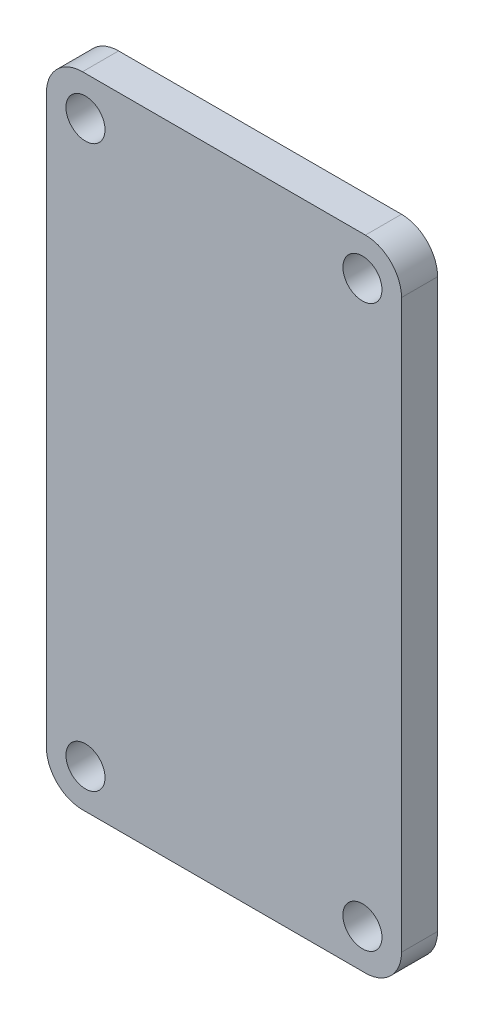
ISO-10303-21;
HEADER;
FILE_DESCRIPTION(('STEP AP214'),'2;1');
FILE_NAME('part.step','',(''),(''),'','','');
FILE_SCHEMA(('AUTOMOTIVE_DESIGN { 1 0 10303 214 1 1 1 1 }'));
ENDSEC;
DATA;
#1=APPLICATION_CONTEXT('core data for automotive mechanical design processes');
#2=APPLICATION_PROTOCOL_DEFINITION('international standard','automotive_design',2000,#1);
#3=PRODUCT_CONTEXT('',#1,'mechanical');
#4=PRODUCT('Part','Part','',(#3));
#5=PRODUCT_RELATED_PRODUCT_CATEGORY('part','',(#4));
#6=PRODUCT_DEFINITION_FORMATION('','',#4);
#7=PRODUCT_DEFINITION_CONTEXT('part definition',#1,'design');
#8=PRODUCT_DEFINITION('design','',#6,#7);
#9=PRODUCT_DEFINITION_SHAPE('','',#8);
#10=(LENGTH_UNIT() NAMED_UNIT(*) SI_UNIT(.MILLI.,.METRE.));
#11=(NAMED_UNIT(*) PLANE_ANGLE_UNIT() SI_UNIT($,.RADIAN.));
#12=(NAMED_UNIT(*) SI_UNIT($,.STERADIAN.) SOLID_ANGLE_UNIT());
#13=UNCERTAINTY_MEASURE_WITH_UNIT(LENGTH_MEASURE(1.E-05),#10,'distance_accuracy_value','');
#14=(GEOMETRIC_REPRESENTATION_CONTEXT(3) GLOBAL_UNCERTAINTY_ASSIGNED_CONTEXT((#13)) GLOBAL_UNIT_ASSIGNED_CONTEXT((#10,
#11,#12)) REPRESENTATION_CONTEXT('',''));
#15=CARTESIAN_POINT('',(0.,0.,0.));
#16=DIRECTION('',(0.,0.,1.));
#17=DIRECTION('',(1.,0.,0.));
#18=AXIS2_PLACEMENT_3D('',#15,#16,#17);
#19=CARTESIAN_POINT('',(0.,0.,2.54));
#20=DIRECTION('',(0.,0.,1.));
#21=DIRECTION('',(1.,0.,0.));
#22=AXIS2_PLACEMENT_3D('',#19,#20,#21);
#23=PLANE('',#22);
#24=CARTESIAN_POINT('',(22.25,-42.25,2.54));
#25=DIRECTION('',(0.,0.,1.));
#26=DIRECTION('',(1.,0.,0.));
#27=AXIS2_PLACEMENT_3D('',#24,#25,#26);
#28=CIRCLE('',#27,1.375);
#29=CARTESIAN_POINT('',(23.625,-42.25,2.54));
#30=VERTEX_POINT('',#29);
#31=EDGE_CURVE('E185',#30,#30,#28,.T.);
#32=ORIENTED_EDGE('',*,*,#31,.F.);
#33=EDGE_LOOP('',(#32));
#34=FACE_BOUND('',#33,.T.);
#35=CARTESIAN_POINT('',(2.75,-2.75,2.54));
#36=DIRECTION('',(0.,0.,1.));
#37=DIRECTION('',(1.,0.,0.));
#38=AXIS2_PLACEMENT_3D('',#35,#36,#37);
#39=CIRCLE('',#38,1.375);
#40=CARTESIAN_POINT('',(4.125,-2.75,2.54));
#41=VERTEX_POINT('',#40);
#42=EDGE_CURVE('E168',#41,#41,#39,.T.);
#43=ORIENTED_EDGE('',*,*,#42,.F.);
#44=EDGE_LOOP('',(#43));
#45=FACE_BOUND('',#44,.T.);
#46=DIRECTION('',(0.,1.,0.));
#47=VECTOR('',#46,1.);
#48=CARTESIAN_POINT('',(25.,0.,2.54));
#49=LINE('',#48,#47);
#50=CARTESIAN_POINT('',(25.,-42.46,2.54));
#51=VERTEX_POINT('',#50);
#52=CARTESIAN_POINT('',(25.,-2.54,2.54));
#53=VERTEX_POINT('',#52);
#54=EDGE_CURVE('E175',#51,#53,#49,.T.);
#55=ORIENTED_EDGE('',*,*,#54,.T.);
#56=CARTESIAN_POINT('',(22.46,-2.54,2.54));
#57=DIRECTION('',(0.,0.,1.));
#58=DIRECTION('',(1.,0.,0.));
#59=AXIS2_PLACEMENT_3D('',#56,#57,#58);
#60=CIRCLE('',#59,2.54);
#61=CARTESIAN_POINT('',(22.46,0.,2.54));
#62=VERTEX_POINT('',#61);
#63=EDGE_CURVE('E152',#53,#62,#60,.T.);
#64=ORIENTED_EDGE('',*,*,#63,.T.);
#65=DIRECTION('',(-1.,0.,0.));
#66=VECTOR('',#65,1.);
#67=CARTESIAN_POINT('',(0.,0.,2.54));
#68=LINE('',#67,#66);
#69=CARTESIAN_POINT('',(2.54,0.,2.54));
#70=VERTEX_POINT('',#69);
#71=EDGE_CURVE('E123',#62,#70,#68,.T.);
#72=ORIENTED_EDGE('',*,*,#71,.T.);
#73=CARTESIAN_POINT('',(2.54,-2.54,2.54));
#74=DIRECTION('',(0.,0.,1.));
#75=DIRECTION('',(1.,0.,0.));
#76=AXIS2_PLACEMENT_3D('',#73,#74,#75);
#77=CIRCLE('',#76,2.54);
#78=CARTESIAN_POINT('',(0.,-2.54,2.54));
#79=VERTEX_POINT('',#78);
#80=EDGE_CURVE('E147',#70,#79,#77,.T.);
#81=ORIENTED_EDGE('',*,*,#80,.T.);
#82=DIRECTION('',(0.,-1.,0.));
#83=VECTOR('',#82,1.);
#84=CARTESIAN_POINT('',(0.,0.,2.54));
#85=LINE('',#84,#83);
#86=CARTESIAN_POINT('',(0.,-42.46,2.54));
#87=VERTEX_POINT('',#86);
#88=EDGE_CURVE('E130',#79,#87,#85,.T.);
#89=ORIENTED_EDGE('',*,*,#88,.T.);
#90=CARTESIAN_POINT('',(2.54000000000001,-42.46,2.54));
#91=DIRECTION('',(0.,0.,1.));
#92=DIRECTION('',(1.,0.,0.));
#93=AXIS2_PLACEMENT_3D('',#90,#91,#92);
#94=CIRCLE('',#93,2.54);
#95=CARTESIAN_POINT('',(2.54000000000001,-45.,2.54));
#96=VERTEX_POINT('',#95);
#97=EDGE_CURVE('E59',#87,#96,#94,.T.);
#98=ORIENTED_EDGE('',*,*,#97,.T.);
#99=DIRECTION('',(1.,0.,0.));
#100=VECTOR('',#99,1.);
#101=CARTESIAN_POINT('',(0.,-45.,2.54));
#102=LINE('',#101,#100);
#103=CARTESIAN_POINT('',(22.46,-45.,2.54));
#104=VERTEX_POINT('',#103);
#105=EDGE_CURVE('E133',#96,#104,#102,.T.);
#106=ORIENTED_EDGE('',*,*,#105,.T.);
#107=CARTESIAN_POINT('',(22.46,-42.46,2.54));
#108=DIRECTION('',(0.,0.,1.));
#109=DIRECTION('',(1.,0.,0.));
#110=AXIS2_PLACEMENT_3D('',#107,#108,#109);
#111=CIRCLE('',#110,2.54);
#112=EDGE_CURVE('E150',#104,#51,#111,.T.);
#113=ORIENTED_EDGE('',*,*,#112,.T.);
#114=EDGE_LOOP('',(#55,#64,#72,#81,#89,#98,#106,#113));
#115=FACE_BOUND('',#114,.T.);
#116=CARTESIAN_POINT('',(2.75,-42.25,2.54));
#117=DIRECTION('',(0.,0.,1.));
#118=DIRECTION('',(-1.,0.,0.));
#119=AXIS2_PLACEMENT_3D('',#116,#117,#118);
#120=CIRCLE('',#119,1.375);
#121=CARTESIAN_POINT('',(1.375,-42.25,2.54));
#122=VERTEX_POINT('',#121);
#123=EDGE_CURVE('E180',#122,#122,#120,.T.);
#124=ORIENTED_EDGE('',*,*,#123,.F.);
#125=EDGE_LOOP('',(#124));
#126=FACE_BOUND('',#125,.T.);
#127=CARTESIAN_POINT('',(22.25,-2.75,2.54));
#128=DIRECTION('',(0.,0.,1.));
#129=DIRECTION('',(-1.,0.,0.));
#130=AXIS2_PLACEMENT_3D('',#127,#128,#129);
#131=CIRCLE('',#130,1.375);
#132=CARTESIAN_POINT('',(20.875,-2.75,2.54));
#133=VERTEX_POINT('',#132);
#134=EDGE_CURVE('E191',#133,#133,#131,.T.);
#135=ORIENTED_EDGE('',*,*,#134,.F.);
#136=EDGE_LOOP('',(#135));
#137=FACE_BOUND('',#136,.T.);
#138=ADVANCED_FACE('F37',(#34,#45,#115,#126,#137),#23,.T.);
#139=CARTESIAN_POINT('',(0.,0.,0.));
#140=DIRECTION('',(0.,0.,1.));
#141=DIRECTION('',(1.,0.,0.));
#142=AXIS2_PLACEMENT_3D('',#139,#140,#141);
#143=PLANE('',#142);
#144=DIRECTION('',(-1.,0.,0.));
#145=VECTOR('',#144,1.);
#146=CARTESIAN_POINT('',(0.,0.,0.));
#147=LINE('',#146,#145);
#148=CARTESIAN_POINT('',(22.46,0.,0.));
#149=VERTEX_POINT('',#148);
#150=CARTESIAN_POINT('',(2.54,0.,0.));
#151=VERTEX_POINT('',#150);
#152=EDGE_CURVE('E120',#149,#151,#147,.T.);
#153=ORIENTED_EDGE('',*,*,#152,.F.);
#154=CARTESIAN_POINT('',(22.46,-2.54,0.));
#155=DIRECTION('',(0.,0.,1.));
#156=DIRECTION('',(1.,0.,0.));
#157=AXIS2_PLACEMENT_3D('',#154,#155,#156);
#158=CIRCLE('',#157,2.54);
#159=CARTESIAN_POINT('',(25.,-2.54,0.));
#160=VERTEX_POINT('',#159);
#161=EDGE_CURVE('E103',#149,#160,#158,.F.);
#162=ORIENTED_EDGE('',*,*,#161,.T.);
#163=DIRECTION('',(0.,1.,0.));
#164=VECTOR('',#163,1.);
#165=CARTESIAN_POINT('',(25.,0.,0.));
#166=LINE('',#165,#164);
#167=CARTESIAN_POINT('',(25.,-42.46,0.));
#168=VERTEX_POINT('',#167);
#169=EDGE_CURVE('E131',#168,#160,#166,.T.);
#170=ORIENTED_EDGE('',*,*,#169,.F.);
#171=CARTESIAN_POINT('',(22.46,-42.46,0.));
#172=DIRECTION('',(0.,0.,1.));
#173=DIRECTION('',(1.,0.,0.));
#174=AXIS2_PLACEMENT_3D('',#171,#172,#173);
#175=CIRCLE('',#174,2.54);
#176=CARTESIAN_POINT('',(22.46,-45.,0.));
#177=VERTEX_POINT('',#176);
#178=EDGE_CURVE('E114',#168,#177,#175,.F.);
#179=ORIENTED_EDGE('',*,*,#178,.T.);
#180=DIRECTION('',(1.,0.,0.));
#181=VECTOR('',#180,1.);
#182=CARTESIAN_POINT('',(0.,-45.,0.));
#183=LINE('',#182,#181);
#184=CARTESIAN_POINT('',(2.54000000000001,-45.,0.));
#185=VERTEX_POINT('',#184);
#186=EDGE_CURVE('E135',#185,#177,#183,.T.);
#187=ORIENTED_EDGE('',*,*,#186,.F.);
#188=CARTESIAN_POINT('',(2.54000000000001,-42.46,0.));
#189=DIRECTION('',(0.,0.,1.));
#190=DIRECTION('',(1.,0.,0.));
#191=AXIS2_PLACEMENT_3D('',#188,#189,#190);
#192=CIRCLE('',#191,2.54);
#193=CARTESIAN_POINT('',(0.,-42.46,0.));
#194=VERTEX_POINT('',#193);
#195=EDGE_CURVE('E141',#185,#194,#192,.F.);
#196=ORIENTED_EDGE('',*,*,#195,.T.);
#197=DIRECTION('',(0.,-1.,0.));
#198=VECTOR('',#197,1.);
#199=CARTESIAN_POINT('',(0.,0.,0.));
#200=LINE('',#199,#198);
#201=CARTESIAN_POINT('',(0.,-2.54,0.));
#202=VERTEX_POINT('',#201);
#203=EDGE_CURVE('E163',#202,#194,#200,.T.);
#204=ORIENTED_EDGE('',*,*,#203,.F.);
#205=CARTESIAN_POINT('',(2.54,-2.54,0.));
#206=DIRECTION('',(0.,0.,1.));
#207=DIRECTION('',(1.,0.,0.));
#208=AXIS2_PLACEMENT_3D('',#205,#206,#207);
#209=CIRCLE('',#208,2.54);
#210=EDGE_CURVE('E124',#202,#151,#209,.F.);
#211=ORIENTED_EDGE('',*,*,#210,.T.);
#212=EDGE_LOOP('',(#153,#162,#170,#179,#187,#196,#204,#211));
#213=FACE_BOUND('',#212,.T.);
#214=CARTESIAN_POINT('',(2.75,-2.75,0.));
#215=DIRECTION('',(0.,0.,1.));
#216=DIRECTION('',(1.,0.,0.));
#217=AXIS2_PLACEMENT_3D('',#214,#215,#216);
#218=CIRCLE('',#217,1.375);
#219=CARTESIAN_POINT('',(4.125,-2.75,0.));
#220=VERTEX_POINT('',#219);
#221=EDGE_CURVE('E171',#220,#220,#218,.T.);
#222=ORIENTED_EDGE('',*,*,#221,.T.);
#223=EDGE_LOOP('',(#222));
#224=FACE_BOUND('',#223,.T.);
#225=CARTESIAN_POINT('',(2.75,-42.25,0.));
#226=DIRECTION('',(0.,0.,1.));
#227=DIRECTION('',(-1.,0.,0.));
#228=AXIS2_PLACEMENT_3D('',#225,#226,#227);
#229=CIRCLE('',#228,1.375);
#230=CARTESIAN_POINT('',(1.375,-42.25,0.));
#231=VERTEX_POINT('',#230);
#232=EDGE_CURVE('E182',#231,#231,#229,.T.);
#233=ORIENTED_EDGE('',*,*,#232,.T.);
#234=EDGE_LOOP('',(#233));
#235=FACE_BOUND('',#234,.T.);
#236=CARTESIAN_POINT('',(22.25,-42.25,0.));
#237=DIRECTION('',(0.,0.,1.));
#238=DIRECTION('',(1.,0.,0.));
#239=AXIS2_PLACEMENT_3D('',#236,#237,#238);
#240=CIRCLE('',#239,1.375);
#241=CARTESIAN_POINT('',(23.625,-42.25,0.));
#242=VERTEX_POINT('',#241);
#243=EDGE_CURVE('E188',#242,#242,#240,.T.);
#244=ORIENTED_EDGE('',*,*,#243,.T.);
#245=EDGE_LOOP('',(#244));
#246=FACE_BOUND('',#245,.T.);
#247=CARTESIAN_POINT('',(22.25,-2.75,0.));
#248=DIRECTION('',(0.,0.,1.));
#249=DIRECTION('',(-1.,0.,0.));
#250=AXIS2_PLACEMENT_3D('',#247,#248,#249);
#251=CIRCLE('',#250,1.375);
#252=CARTESIAN_POINT('',(20.875,-2.75,0.));
#253=VERTEX_POINT('',#252);
#254=EDGE_CURVE('E194',#253,#253,#251,.T.);
#255=ORIENTED_EDGE('',*,*,#254,.T.);
#256=EDGE_LOOP('',(#255));
#257=FACE_BOUND('',#256,.T.);
#258=ADVANCED_FACE('F127',(#213,#224,#235,#246,#257),#143,.F.);
#259=CARTESIAN_POINT('',(0.,0.,2.54));
#260=DIRECTION('',(1.,0.,0.));
#261=DIRECTION('',(0.,1.,0.));
#262=AXIS2_PLACEMENT_3D('',#259,#260,#261);
#263=PLANE('',#262);
#264=ORIENTED_EDGE('',*,*,#203,.T.);
#265=DIRECTION('',(0.,0.,-1.));
#266=VECTOR('',#265,1.);
#267=CARTESIAN_POINT('',(0.,-42.46,2.54));
#268=LINE('',#267,#266);
#269=EDGE_CURVE('E11',#194,#87,#268,.F.);
#270=ORIENTED_EDGE('',*,*,#269,.T.);
#271=ORIENTED_EDGE('',*,*,#88,.F.);
#272=DIRECTION('',(0.,0.,-1.));
#273=VECTOR('',#272,1.);
#274=CARTESIAN_POINT('',(0.,-2.54,2.54));
#275=LINE('',#274,#273);
#276=EDGE_CURVE('E45',#79,#202,#275,.T.);
#277=ORIENTED_EDGE('',*,*,#276,.T.);
#278=EDGE_LOOP('',(#264,#270,#271,#277));
#279=FACE_BOUND('',#278,.T.);
#280=ADVANCED_FACE('F162',(#279),#263,.F.);
#281=CARTESIAN_POINT('',(0.,-45.,2.54));
#282=DIRECTION('',(0.,1.,0.));
#283=DIRECTION('',(0.,0.,1.));
#284=AXIS2_PLACEMENT_3D('',#281,#282,#283);
#285=PLANE('',#284);
#286=ORIENTED_EDGE('',*,*,#186,.T.);
#287=DIRECTION('',(0.,0.,-1.));
#288=VECTOR('',#287,1.);
#289=CARTESIAN_POINT('',(22.46,-45.,2.54));
#290=LINE('',#289,#288);
#291=EDGE_CURVE('E52',#177,#104,#290,.F.);
#292=ORIENTED_EDGE('',*,*,#291,.T.);
#293=ORIENTED_EDGE('',*,*,#105,.F.);
#294=DIRECTION('',(0.,0.,-1.));
#295=VECTOR('',#294,1.);
#296=CARTESIAN_POINT('',(2.54000000000001,-45.,2.54));
#297=LINE('',#296,#295);
#298=EDGE_CURVE('E154',#96,#185,#297,.T.);
#299=ORIENTED_EDGE('',*,*,#298,.T.);
#300=EDGE_LOOP('',(#286,#292,#293,#299));
#301=FACE_BOUND('',#300,.T.);
#302=ADVANCED_FACE('F221',(#301),#285,.F.);
#303=CARTESIAN_POINT('',(25.,0.,2.54));
#304=DIRECTION('',(-1.,0.,0.));
#305=DIRECTION('',(0.,-1.,0.));
#306=AXIS2_PLACEMENT_3D('',#303,#304,#305);
#307=PLANE('',#306);
#308=ORIENTED_EDGE('',*,*,#169,.T.);
#309=DIRECTION('',(0.,0.,-1.));
#310=VECTOR('',#309,1.);
#311=CARTESIAN_POINT('',(25.,-2.54,2.54));
#312=LINE('',#311,#310);
#313=EDGE_CURVE('E108',#160,#53,#312,.F.);
#314=ORIENTED_EDGE('',*,*,#313,.T.);
#315=ORIENTED_EDGE('',*,*,#54,.F.);
#316=DIRECTION('',(0.,0.,-1.));
#317=VECTOR('',#316,1.);
#318=CARTESIAN_POINT('',(25.,-42.46,2.54));
#319=LINE('',#318,#317);
#320=EDGE_CURVE('E113',#51,#168,#319,.T.);
#321=ORIENTED_EDGE('',*,*,#320,.T.);
#322=EDGE_LOOP('',(#308,#314,#315,#321));
#323=FACE_BOUND('',#322,.T.);
#324=ADVANCED_FACE('F218',(#323),#307,.F.);
#325=CARTESIAN_POINT('',(0.,0.,2.54));
#326=DIRECTION('',(0.,-1.,0.));
#327=DIRECTION('',(0.,0.,-1.));
#328=AXIS2_PLACEMENT_3D('',#325,#326,#327);
#329=PLANE('',#328);
#330=ORIENTED_EDGE('',*,*,#71,.F.);
#331=DIRECTION('',(0.,0.,-1.));
#332=VECTOR('',#331,1.);
#333=CARTESIAN_POINT('',(22.46,0.,2.54));
#334=LINE('',#333,#332);
#335=EDGE_CURVE('E107',#62,#149,#334,.T.);
#336=ORIENTED_EDGE('',*,*,#335,.T.);
#337=ORIENTED_EDGE('',*,*,#152,.T.);
#338=DIRECTION('',(0.,0.,-1.));
#339=VECTOR('',#338,1.);
#340=CARTESIAN_POINT('',(2.54,0.,2.54));
#341=LINE('',#340,#339);
#342=EDGE_CURVE('E125',#151,#70,#341,.F.);
#343=ORIENTED_EDGE('',*,*,#342,.T.);
#344=EDGE_LOOP('',(#330,#336,#337,#343));
#345=FACE_BOUND('',#344,.T.);
#346=ADVANCED_FACE('F119',(#345),#329,.F.);
#347=CARTESIAN_POINT('',(2.75,-2.75,2.54));
#348=DIRECTION('',(0.,0.,-1.));
#349=DIRECTION('',(-1.,0.,0.));
#350=AXIS2_PLACEMENT_3D('',#347,#348,#349);
#351=CYLINDRICAL_SURFACE('',#350,1.375);
#352=ORIENTED_EDGE('',*,*,#42,.T.);
#353=EDGE_LOOP('',(#352));
#354=FACE_BOUND('',#353,.T.);
#355=ORIENTED_EDGE('',*,*,#221,.F.);
#356=EDGE_LOOP('',(#355));
#357=FACE_BOUND('',#356,.T.);
#358=ADVANCED_FACE('F213',(#354,#357),#351,.F.);
#359=CARTESIAN_POINT('',(2.75,-42.25,2.54));
#360=DIRECTION('',(0.,0.,-1.));
#361=DIRECTION('',(-1.,0.,0.));
#362=AXIS2_PLACEMENT_3D('',#359,#360,#361);
#363=CYLINDRICAL_SURFACE('',#362,1.375);
#364=ORIENTED_EDGE('',*,*,#123,.T.);
#365=EDGE_LOOP('',(#364));
#366=FACE_BOUND('',#365,.T.);
#367=ORIENTED_EDGE('',*,*,#232,.F.);
#368=EDGE_LOOP('',(#367));
#369=FACE_BOUND('',#368,.T.);
#370=ADVANCED_FACE('F245',(#366,#369),#363,.F.);
#371=CARTESIAN_POINT('',(22.25,-42.25,2.54));
#372=DIRECTION('',(0.,0.,-1.));
#373=DIRECTION('',(-1.,0.,0.));
#374=AXIS2_PLACEMENT_3D('',#371,#372,#373);
#375=CYLINDRICAL_SURFACE('',#374,1.375);
#376=ORIENTED_EDGE('',*,*,#31,.T.);
#377=EDGE_LOOP('',(#376));
#378=FACE_BOUND('',#377,.T.);
#379=ORIENTED_EDGE('',*,*,#243,.F.);
#380=EDGE_LOOP('',(#379));
#381=FACE_BOUND('',#380,.T.);
#382=ADVANCED_FACE('F248',(#378,#381),#375,.F.);
#383=CARTESIAN_POINT('',(22.25,-2.75,2.54));
#384=DIRECTION('',(0.,0.,-1.));
#385=DIRECTION('',(-1.,0.,0.));
#386=AXIS2_PLACEMENT_3D('',#383,#384,#385);
#387=CYLINDRICAL_SURFACE('',#386,1.375);
#388=ORIENTED_EDGE('',*,*,#134,.T.);
#389=EDGE_LOOP('',(#388));
#390=FACE_BOUND('',#389,.T.);
#391=ORIENTED_EDGE('',*,*,#254,.F.);
#392=EDGE_LOOP('',(#391));
#393=FACE_BOUND('',#392,.T.);
#394=ADVANCED_FACE('F200',(#390,#393),#387,.F.);
#395=CARTESIAN_POINT('',(22.46,-2.54,2.54));
#396=DIRECTION('',(0.,0.,-1.));
#397=DIRECTION('',(-1.,0.,0.));
#398=AXIS2_PLACEMENT_3D('',#395,#396,#397);
#399=CYLINDRICAL_SURFACE('',#398,2.54);
#400=ORIENTED_EDGE('',*,*,#63,.F.);
#401=ORIENTED_EDGE('',*,*,#313,.F.);
#402=ORIENTED_EDGE('',*,*,#161,.F.);
#403=ORIENTED_EDGE('',*,*,#335,.F.);
#404=EDGE_LOOP('',(#400,#401,#402,#403));
#405=FACE_BOUND('',#404,.T.);
#406=ADVANCED_FACE('F106',(#405),#399,.T.);
#407=CARTESIAN_POINT('',(22.46,-42.46,2.54));
#408=DIRECTION('',(0.,0.,-1.));
#409=DIRECTION('',(-1.,0.,0.));
#410=AXIS2_PLACEMENT_3D('',#407,#408,#409);
#411=CYLINDRICAL_SURFACE('',#410,2.54);
#412=ORIENTED_EDGE('',*,*,#112,.F.);
#413=ORIENTED_EDGE('',*,*,#291,.F.);
#414=ORIENTED_EDGE('',*,*,#178,.F.);
#415=ORIENTED_EDGE('',*,*,#320,.F.);
#416=EDGE_LOOP('',(#412,#413,#414,#415));
#417=FACE_BOUND('',#416,.T.);
#418=ADVANCED_FACE('F229',(#417),#411,.T.);
#419=CARTESIAN_POINT('',(2.54000000000001,-42.46,2.54));
#420=DIRECTION('',(0.,0.,-1.));
#421=DIRECTION('',(-1.,0.,0.));
#422=AXIS2_PLACEMENT_3D('',#419,#420,#421);
#423=CYLINDRICAL_SURFACE('',#422,2.54);
#424=ORIENTED_EDGE('',*,*,#97,.F.);
#425=ORIENTED_EDGE('',*,*,#269,.F.);
#426=ORIENTED_EDGE('',*,*,#195,.F.);
#427=ORIENTED_EDGE('',*,*,#298,.F.);
#428=EDGE_LOOP('',(#424,#425,#426,#427));
#429=FACE_BOUND('',#428,.T.);
#430=ADVANCED_FACE('F231',(#429),#423,.T.);
#431=CARTESIAN_POINT('',(2.54,-2.54,2.54));
#432=DIRECTION('',(0.,0.,-1.));
#433=DIRECTION('',(-1.,0.,0.));
#434=AXIS2_PLACEMENT_3D('',#431,#432,#433);
#435=CYLINDRICAL_SURFACE('',#434,2.54);
#436=ORIENTED_EDGE('',*,*,#80,.F.);
#437=ORIENTED_EDGE('',*,*,#342,.F.);
#438=ORIENTED_EDGE('',*,*,#210,.F.);
#439=ORIENTED_EDGE('',*,*,#276,.F.);
#440=EDGE_LOOP('',(#436,#437,#438,#439));
#441=FACE_BOUND('',#440,.T.);
#442=ADVANCED_FACE('F39',(#441),#435,.T.);
#443=CLOSED_SHELL('',(#138,#258,#280,#302,#324,#346,#358,#370,#382,#394,#406,#418,#430,#442));
#444=MANIFOLD_SOLID_BREP('B2',#443);
#445=ADVANCED_BREP_SHAPE_REPRESENTATION('',(#18,#444),#14);
#446=SHAPE_DEFINITION_REPRESENTATION(#9,#445);
ENDSEC;
END-ISO-10303-21;
